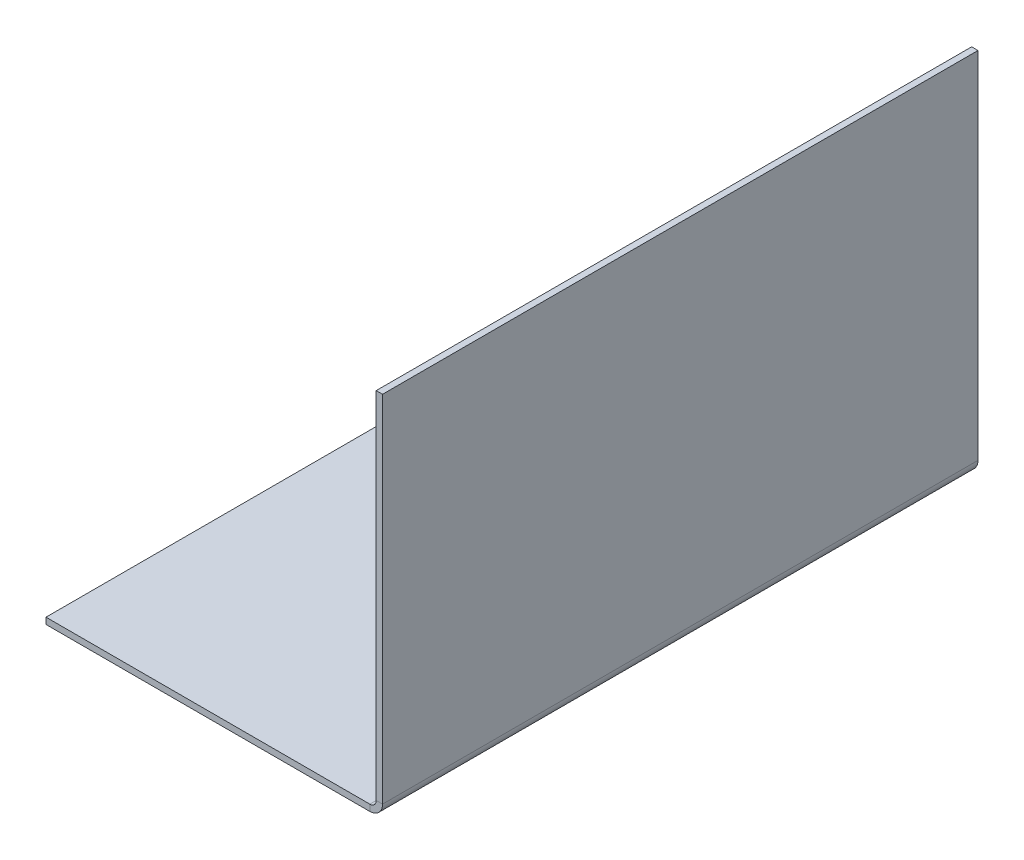
ISO-10303-21;
HEADER;
FILE_DESCRIPTION(('STEP AP214'),'2;1');
FILE_NAME('part.step','',(''),(''),'','','');
FILE_SCHEMA(('AUTOMOTIVE_DESIGN { 1 0 10303 214 1 1 1 1 }'));
ENDSEC;
DATA;
#1=APPLICATION_CONTEXT('core data for automotive mechanical design processes');
#2=APPLICATION_PROTOCOL_DEFINITION('international standard','automotive_design',2000,#1);
#3=PRODUCT_CONTEXT('',#1,'mechanical');
#4=PRODUCT('Part','Part','',(#3));
#5=PRODUCT_RELATED_PRODUCT_CATEGORY('part','',(#4));
#6=PRODUCT_DEFINITION_FORMATION('','',#4);
#7=PRODUCT_DEFINITION_CONTEXT('part definition',#1,'design');
#8=PRODUCT_DEFINITION('design','',#6,#7);
#9=PRODUCT_DEFINITION_SHAPE('','',#8);
#10=(LENGTH_UNIT() NAMED_UNIT(*) SI_UNIT(.MILLI.,.METRE.));
#11=(NAMED_UNIT(*) PLANE_ANGLE_UNIT() SI_UNIT($,.RADIAN.));
#12=(NAMED_UNIT(*) SI_UNIT($,.STERADIAN.) SOLID_ANGLE_UNIT());
#13=UNCERTAINTY_MEASURE_WITH_UNIT(LENGTH_MEASURE(1.E-05),#10,'distance_accuracy_value','');
#14=(GEOMETRIC_REPRESENTATION_CONTEXT(3) GLOBAL_UNCERTAINTY_ASSIGNED_CONTEXT((#13)) GLOBAL_UNIT_ASSIGNED_CONTEXT((#10,
#11,#12)) REPRESENTATION_CONTEXT('',''));
#15=CARTESIAN_POINT('',(0.,0.,0.));
#16=DIRECTION('',(0.,0.,1.));
#17=DIRECTION('',(1.,0.,0.));
#18=AXIS2_PLACEMENT_3D('',#15,#16,#17);
#19=CARTESIAN_POINT('',(-41.8986123106526,-37.5560128967712,0.));
#20=DIRECTION('',(0.,0.,1.));
#21=DIRECTION('',(0.,1.,0.));
#22=AXIS2_PLACEMENT_3D('',#19,#20,#21);
#23=PLANE('',#22);
#24=DIRECTION('',(0.,-1.,0.));
#25=VECTOR('',#24,1.);
#26=CARTESIAN_POINT('',(-41.1620123106529,42.6042491640405,0.));
#27=LINE('',#26,#25);
#28=CARTESIAN_POINT('',(-41.1620123106529,42.6042491640405,0.));
#29=VERTEX_POINT('',#28);
#30=CARTESIAN_POINT('',(-41.1620123106527,1.47320000000001,0.));
#31=VERTEX_POINT('',#30);
#32=EDGE_CURVE('E160',#29,#31,#27,.T.);
#33=ORIENTED_EDGE('',*,*,#32,.T.);
#34=DIRECTION('',(-1.,0.,0.));
#35=VECTOR('',#34,1.);
#36=CARTESIAN_POINT('',(-41.8986123106528,1.47320000000001,0.));
#37=LINE('',#36,#35);
#38=CARTESIAN_POINT('',(-41.8986123106528,1.47320000000001,0.));
#39=VERTEX_POINT('',#38);
#40=EDGE_CURVE('E12',#31,#39,#37,.T.);
#41=ORIENTED_EDGE('',*,*,#40,.T.);
#42=DIRECTION('',(0.,1.,0.));
#43=VECTOR('',#42,1.);
#44=CARTESIAN_POINT('',(-41.8986123106529,42.6042491640405,0.));
#45=LINE('',#44,#43);
#46=CARTESIAN_POINT('',(-41.8986123106529,42.6042491640405,0.));
#47=VERTEX_POINT('',#46);
#48=EDGE_CURVE('E56',#47,#39,#45,.F.);
#49=ORIENTED_EDGE('',*,*,#48,.F.);
#50=DIRECTION('',(1.,0.,0.));
#51=VECTOR('',#50,1.);
#52=CARTESIAN_POINT('',(-41.8986123106529,42.6042491640405,0.));
#53=LINE('',#52,#51);
#54=EDGE_CURVE('E157',#47,#29,#53,.T.);
#55=ORIENTED_EDGE('',*,*,#54,.T.);
#56=EDGE_LOOP('',(#33,#41,#49,#55));
#57=FACE_BOUND('',#56,.T.);
#58=ADVANCED_FACE('F40',(#57),#23,.F.);
#59=CARTESIAN_POINT('',(-41.8986123106529,42.6042491640405,69.));
#60=DIRECTION('',(1.,0.,0.));
#61=DIRECTION('',(0.,0.,-1.));
#62=AXIS2_PLACEMENT_3D('',#59,#60,#61);
#63=PLANE('',#62);
#64=ORIENTED_EDGE('',*,*,#48,.T.);
#65=DIRECTION('',(0.,0.,1.));
#66=VECTOR('',#65,1.);
#67=CARTESIAN_POINT('',(-41.8986123106528,1.47320000000001,69.));
#68=LINE('',#67,#66);
#69=CARTESIAN_POINT('',(-41.8986123106528,1.47320000000001,69.));
#70=VERTEX_POINT('',#69);
#71=EDGE_CURVE('E48',#39,#70,#68,.T.);
#72=ORIENTED_EDGE('',*,*,#71,.T.);
#73=DIRECTION('',(0.,1.,0.));
#74=VECTOR('',#73,1.);
#75=CARTESIAN_POINT('',(-41.8986123106529,42.6042491640405,69.));
#76=LINE('',#75,#74);
#77=CARTESIAN_POINT('',(-41.8986123106529,42.6042491640405,69.));
#78=VERTEX_POINT('',#77);
#79=EDGE_CURVE('E63',#78,#70,#76,.F.);
#80=ORIENTED_EDGE('',*,*,#79,.F.);
#81=DIRECTION('',(0.,0.,-1.));
#82=VECTOR('',#81,1.);
#83=CARTESIAN_POINT('',(-41.8986123106529,42.6042491640405,69.));
#84=LINE('',#83,#82);
#85=EDGE_CURVE('E156',#78,#47,#84,.T.);
#86=ORIENTED_EDGE('',*,*,#85,.T.);
#87=EDGE_LOOP('',(#64,#72,#80,#86));
#88=FACE_BOUND('',#87,.T.);
#89=ADVANCED_FACE('F180',(#88),#63,.F.);
#90=CARTESIAN_POINT('',(-41.1620123106529,42.6042491640405,69.));
#91=DIRECTION('',(1.,0.,0.));
#92=DIRECTION('',(0.,0.,-1.));
#93=AXIS2_PLACEMENT_3D('',#90,#91,#92);
#94=PLANE('',#93);
#95=DIRECTION('',(0.,0.,1.));
#96=VECTOR('',#95,1.);
#97=CARTESIAN_POINT('',(-41.1620123106527,1.47320000000001,69.));
#98=LINE('',#97,#96);
#99=CARTESIAN_POINT('',(-41.1620123106527,1.47320000000001,69.));
#100=VERTEX_POINT('',#99);
#101=EDGE_CURVE('E126',#31,#100,#98,.T.);
#102=ORIENTED_EDGE('',*,*,#101,.F.);
#103=ORIENTED_EDGE('',*,*,#32,.F.);
#104=DIRECTION('',(0.,0.,-1.));
#105=VECTOR('',#104,1.);
#106=CARTESIAN_POINT('',(-41.1620123106529,42.6042491640405,69.));
#107=LINE('',#106,#105);
#108=CARTESIAN_POINT('',(-41.1620123106529,42.6042491640405,69.));
#109=VERTEX_POINT('',#108);
#110=EDGE_CURVE('E162',#109,#29,#107,.T.);
#111=ORIENTED_EDGE('',*,*,#110,.F.);
#112=DIRECTION('',(0.,-1.,0.));
#113=VECTOR('',#112,1.);
#114=CARTESIAN_POINT('',(-41.1620123106529,42.6042491640405,69.));
#115=LINE('',#114,#113);
#116=EDGE_CURVE('E43',#109,#100,#115,.T.);
#117=ORIENTED_EDGE('',*,*,#116,.T.);
#118=EDGE_LOOP('',(#102,#103,#111,#117));
#119=FACE_BOUND('',#118,.T.);
#120=ADVANCED_FACE('F174',(#119),#94,.T.);
#121=CARTESIAN_POINT('',(-41.8986123106529,42.6042491640405,69.));
#122=DIRECTION('',(0.,1.,0.));
#123=DIRECTION('',(0.,0.,-1.));
#124=AXIS2_PLACEMENT_3D('',#121,#122,#123);
#125=PLANE('',#124);
#126=ORIENTED_EDGE('',*,*,#54,.F.);
#127=ORIENTED_EDGE('',*,*,#85,.F.);
#128=DIRECTION('',(1.,0.,0.));
#129=VECTOR('',#128,1.);
#130=CARTESIAN_POINT('',(-41.8986123106529,42.6042491640405,69.));
#131=LINE('',#130,#129);
#132=EDGE_CURVE('E153',#78,#109,#131,.T.);
#133=ORIENTED_EDGE('',*,*,#132,.T.);
#134=ORIENTED_EDGE('',*,*,#110,.T.);
#135=EDGE_LOOP('',(#126,#127,#133,#134));
#136=FACE_BOUND('',#135,.T.);
#137=ADVANCED_FACE('F179',(#136),#125,.T.);
#138=CARTESIAN_POINT('',(-41.8986123106526,-37.5560128967712,69.));
#139=DIRECTION('',(0.,0.,1.));
#140=DIRECTION('',(0.,1.,0.));
#141=AXIS2_PLACEMENT_3D('',#138,#139,#140);
#142=PLANE('',#141);
#143=DIRECTION('',(-1.,0.,0.));
#144=VECTOR('',#143,1.);
#145=CARTESIAN_POINT('',(-41.8986123106528,1.47320000000001,69.));
#146=LINE('',#145,#144);
#147=EDGE_CURVE('E165',#100,#70,#146,.T.);
#148=ORIENTED_EDGE('',*,*,#147,.F.);
#149=ORIENTED_EDGE('',*,*,#116,.F.);
#150=ORIENTED_EDGE('',*,*,#132,.F.);
#151=ORIENTED_EDGE('',*,*,#79,.T.);
#152=EDGE_LOOP('',(#148,#149,#150,#151));
#153=FACE_BOUND('',#152,.T.);
#154=ADVANCED_FACE('F176',(#153),#142,.T.);
#155=CARTESIAN_POINT('',(-80.1602620608117,0.,69.));
#156=DIRECTION('',(-1.,0.,0.));
#157=DIRECTION('',(0.,0.,1.));
#158=AXIS2_PLACEMENT_3D('',#155,#156,#157);
#159=PLANE('',#158);
#160=DIRECTION('',(0.,1.,0.));
#161=VECTOR('',#160,1.);
#162=CARTESIAN_POINT('',(-80.1602620608117,0.,0.));
#163=LINE('',#162,#161);
#164=CARTESIAN_POINT('',(-80.1602620608117,0.,0.));
#165=VERTEX_POINT('',#164);
#166=CARTESIAN_POINT('',(-80.1602620608117,0.7366,0.));
#167=VERTEX_POINT('',#166);
#168=EDGE_CURVE('E170',#165,#167,#163,.T.);
#169=ORIENTED_EDGE('',*,*,#168,.F.);
#170=DIRECTION('',(0.,0.,-1.));
#171=VECTOR('',#170,1.);
#172=CARTESIAN_POINT('',(-80.1602620608117,0.,69.));
#173=LINE('',#172,#171);
#174=CARTESIAN_POINT('',(-80.1602620608117,0.,69.));
#175=VERTEX_POINT('',#174);
#176=EDGE_CURVE('E117',#175,#165,#173,.T.);
#177=ORIENTED_EDGE('',*,*,#176,.F.);
#178=DIRECTION('',(0.,1.,0.));
#179=VECTOR('',#178,1.);
#180=CARTESIAN_POINT('',(-80.1602620608117,0.,69.));
#181=LINE('',#180,#179);
#182=CARTESIAN_POINT('',(-80.1602620608117,0.7366,69.));
#183=VERTEX_POINT('',#182);
#184=EDGE_CURVE('E143',#175,#183,#181,.T.);
#185=ORIENTED_EDGE('',*,*,#184,.T.);
#186=DIRECTION('',(0.,0.,-1.));
#187=VECTOR('',#186,1.);
#188=CARTESIAN_POINT('',(-80.1602620608117,0.7366,69.));
#189=LINE('',#188,#187);
#190=EDGE_CURVE('E138',#183,#167,#189,.T.);
#191=ORIENTED_EDGE('',*,*,#190,.T.);
#192=EDGE_LOOP('',(#169,#177,#185,#191));
#193=FACE_BOUND('',#192,.T.);
#194=ADVANCED_FACE('F204',(#193),#159,.T.);
#195=CARTESIAN_POINT('',(0.,0.,69.));
#196=DIRECTION('',(0.,-1.,0.));
#197=DIRECTION('',(0.,0.,-1.));
#198=AXIS2_PLACEMENT_3D('',#195,#196,#197);
#199=PLANE('',#198);
#200=DIRECTION('',(-1.,0.,0.));
#201=VECTOR('',#200,1.);
#202=CARTESIAN_POINT('',(0.,0.,0.));
#203=LINE('',#202,#201);
#204=CARTESIAN_POINT('',(-42.6352123106528,0.,0.));
#205=VERTEX_POINT('',#204);
#206=EDGE_CURVE('E136',#205,#165,#203,.T.);
#207=ORIENTED_EDGE('',*,*,#206,.F.);
#208=DIRECTION('',(0.,0.,1.));
#209=VECTOR('',#208,1.);
#210=CARTESIAN_POINT('',(-42.6352123106528,0.,69.));
#211=LINE('',#210,#209);
#212=CARTESIAN_POINT('',(-42.6352123106528,0.,69.));
#213=VERTEX_POINT('',#212);
#214=EDGE_CURVE('E124',#205,#213,#211,.T.);
#215=ORIENTED_EDGE('',*,*,#214,.T.);
#216=DIRECTION('',(-1.,0.,0.));
#217=VECTOR('',#216,1.);
#218=CARTESIAN_POINT('',(0.,0.,69.));
#219=LINE('',#218,#217);
#220=EDGE_CURVE('E134',#213,#175,#219,.T.);
#221=ORIENTED_EDGE('',*,*,#220,.T.);
#222=ORIENTED_EDGE('',*,*,#176,.T.);
#223=EDGE_LOOP('',(#207,#215,#221,#222));
#224=FACE_BOUND('',#223,.T.);
#225=ADVANCED_FACE('F132',(#224),#199,.T.);
#226=CARTESIAN_POINT('',(-80.1602620608117,0.7366,69.));
#227=DIRECTION('',(0.,0.,1.));
#228=DIRECTION('',(1.,0.,0.));
#229=AXIS2_PLACEMENT_3D('',#226,#227,#228);
#230=PLANE('',#229);
#231=ORIENTED_EDGE('',*,*,#220,.F.);
#232=DIRECTION('',(0.,1.,0.));
#233=VECTOR('',#232,1.);
#234=CARTESIAN_POINT('',(-42.6352123106528,0.7366,69.));
#235=LINE('',#234,#233);
#236=CARTESIAN_POINT('',(-42.6352123106528,0.7366,69.));
#237=VERTEX_POINT('',#236);
#238=EDGE_CURVE('E106',#213,#237,#235,.T.);
#239=ORIENTED_EDGE('',*,*,#238,.T.);
#240=DIRECTION('',(1.,0.,0.));
#241=VECTOR('',#240,1.);
#242=CARTESIAN_POINT('',(0.,0.7366,69.));
#243=LINE('',#242,#241);
#244=EDGE_CURVE('E116',#237,#183,#243,.F.);
#245=ORIENTED_EDGE('',*,*,#244,.T.);
#246=ORIENTED_EDGE('',*,*,#184,.F.);
#247=EDGE_LOOP('',(#231,#239,#245,#246));
#248=FACE_BOUND('',#247,.T.);
#249=ADVANCED_FACE('F141',(#248),#230,.T.);
#250=CARTESIAN_POINT('',(0.,0.7366,69.));
#251=DIRECTION('',(0.,-1.,0.));
#252=DIRECTION('',(0.,0.,-1.));
#253=AXIS2_PLACEMENT_3D('',#250,#251,#252);
#254=PLANE('',#253);
#255=DIRECTION('',(0.,0.,1.));
#256=VECTOR('',#255,1.);
#257=CARTESIAN_POINT('',(-42.6352123106528,0.7366,69.));
#258=LINE('',#257,#256);
#259=CARTESIAN_POINT('',(-42.6352123106528,0.7366,0.));
#260=VERTEX_POINT('',#259);
#261=EDGE_CURVE('E150',#260,#237,#258,.T.);
#262=ORIENTED_EDGE('',*,*,#261,.F.);
#263=DIRECTION('',(1.,0.,0.));
#264=VECTOR('',#263,1.);
#265=CARTESIAN_POINT('',(0.,0.7366,0.));
#266=LINE('',#265,#264);
#267=EDGE_CURVE('E196',#260,#167,#266,.F.);
#268=ORIENTED_EDGE('',*,*,#267,.T.);
#269=ORIENTED_EDGE('',*,*,#190,.F.);
#270=ORIENTED_EDGE('',*,*,#244,.F.);
#271=EDGE_LOOP('',(#262,#268,#269,#270));
#272=FACE_BOUND('',#271,.T.);
#273=ADVANCED_FACE('F200',(#272),#254,.F.);
#274=CARTESIAN_POINT('',(-80.1602620608117,0.7366,0.));
#275=DIRECTION('',(0.,0.,1.));
#276=DIRECTION('',(1.,0.,0.));
#277=AXIS2_PLACEMENT_3D('',#274,#275,#276);
#278=PLANE('',#277);
#279=DIRECTION('',(0.,1.,0.));
#280=VECTOR('',#279,1.);
#281=CARTESIAN_POINT('',(-42.6352123106528,0.7366,0.));
#282=LINE('',#281,#280);
#283=EDGE_CURVE('E127',#205,#260,#282,.T.);
#284=ORIENTED_EDGE('',*,*,#283,.F.);
#285=ORIENTED_EDGE('',*,*,#206,.T.);
#286=ORIENTED_EDGE('',*,*,#168,.T.);
#287=ORIENTED_EDGE('',*,*,#267,.F.);
#288=EDGE_LOOP('',(#284,#285,#286,#287));
#289=FACE_BOUND('',#288,.T.);
#290=ADVANCED_FACE('F206',(#289),#278,.F.);
#291=CARTESIAN_POINT('',(-42.6352123106528,1.4732,0.));
#292=DIRECTION('',(0.,0.,-1.));
#293=DIRECTION('',(-1.,0.,0.));
#294=AXIS2_PLACEMENT_3D('',#291,#292,#293);
#295=PLANE('',#294);
#296=ORIENTED_EDGE('',*,*,#283,.T.);
#297=CARTESIAN_POINT('',(-42.6352123106528,1.4732,0.));
#298=DIRECTION('',(0.,0.,1.));
#299=DIRECTION('',(1.,0.,0.));
#300=AXIS2_PLACEMENT_3D('',#297,#298,#299);
#301=CIRCLE('',#300,0.7366);
#302=EDGE_CURVE('E188',#260,#39,#301,.T.);
#303=ORIENTED_EDGE('',*,*,#302,.T.);
#304=ORIENTED_EDGE('',*,*,#40,.F.);
#305=CARTESIAN_POINT('',(-42.6352123106528,1.4732,0.));
#306=DIRECTION('',(0.,0.,1.));
#307=DIRECTION('',(-1.,0.,0.));
#308=AXIS2_PLACEMENT_3D('',#305,#306,#307);
#309=CIRCLE('',#308,1.4732);
#310=EDGE_CURVE('E128',#205,#31,#309,.T.);
#311=ORIENTED_EDGE('',*,*,#310,.F.);
#312=EDGE_LOOP('',(#296,#303,#304,#311));
#313=FACE_BOUND('',#312,.T.);
#314=ADVANCED_FACE('F208',(#313),#295,.T.);
#315=CARTESIAN_POINT('',(-42.6352123106528,1.4732,69.));
#316=DIRECTION('',(0.,0.,1.));
#317=DIRECTION('',(1.,0.,0.));
#318=AXIS2_PLACEMENT_3D('',#315,#316,#317);
#319=PLANE('',#318);
#320=CARTESIAN_POINT('',(-42.6352123106528,1.4732,69.));
#321=DIRECTION('',(0.,0.,1.));
#322=DIRECTION('',(1.,0.,0.));
#323=AXIS2_PLACEMENT_3D('',#320,#321,#322);
#324=CIRCLE('',#323,0.7366);
#325=EDGE_CURVE('E112',#70,#237,#324,.F.);
#326=ORIENTED_EDGE('',*,*,#325,.T.);
#327=ORIENTED_EDGE('',*,*,#238,.F.);
#328=CARTESIAN_POINT('',(-42.6352123106528,1.4732,69.));
#329=DIRECTION('',(0.,0.,-1.));
#330=DIRECTION('',(-1.,0.,0.));
#331=AXIS2_PLACEMENT_3D('',#328,#329,#330);
#332=CIRCLE('',#331,1.4732);
#333=EDGE_CURVE('E110',#100,#213,#332,.T.);
#334=ORIENTED_EDGE('',*,*,#333,.F.);
#335=ORIENTED_EDGE('',*,*,#147,.T.);
#336=EDGE_LOOP('',(#326,#327,#334,#335));
#337=FACE_BOUND('',#336,.T.);
#338=ADVANCED_FACE('F108',(#337),#319,.T.);
#339=CARTESIAN_POINT('',(-42.6352123106528,1.4732,-34.5203237194062));
#340=DIRECTION('',(0.,0.,1.));
#341=DIRECTION('',(1.,0.,0.));
#342=AXIS2_PLACEMENT_3D('',#339,#340,#341);
#343=CYLINDRICAL_SURFACE('',#342,1.4732);
#344=ORIENTED_EDGE('',*,*,#101,.T.);
#345=ORIENTED_EDGE('',*,*,#333,.T.);
#346=ORIENTED_EDGE('',*,*,#214,.F.);
#347=ORIENTED_EDGE('',*,*,#310,.T.);
#348=EDGE_LOOP('',(#344,#345,#346,#347));
#349=FACE_BOUND('',#348,.T.);
#350=ADVANCED_FACE('F122',(#349),#343,.T.);
#351=CARTESIAN_POINT('',(-42.6352123106528,1.4732,-34.5203237194062));
#352=DIRECTION('',(0.,0.,1.));
#353=DIRECTION('',(1.,0.,0.));
#354=AXIS2_PLACEMENT_3D('',#351,#352,#353);
#355=CYLINDRICAL_SURFACE('',#354,0.7366);
#356=ORIENTED_EDGE('',*,*,#71,.F.);
#357=ORIENTED_EDGE('',*,*,#302,.F.);
#358=ORIENTED_EDGE('',*,*,#261,.T.);
#359=ORIENTED_EDGE('',*,*,#325,.F.);
#360=EDGE_LOOP('',(#356,#357,#358,#359));
#361=FACE_BOUND('',#360,.T.);
#362=ADVANCED_FACE('F185',(#361),#355,.F.);
#363=CLOSED_SHELL('',(#58,#89,#120,#137,#154,#194,#225,#249,#273,#290,#314,#338,#350,#362));
#364=MANIFOLD_SOLID_BREP('B2',#363);
#365=ADVANCED_BREP_SHAPE_REPRESENTATION('',(#18,#364),#14);
#366=SHAPE_DEFINITION_REPRESENTATION(#9,#365);
ENDSEC;
END-ISO-10303-21;
